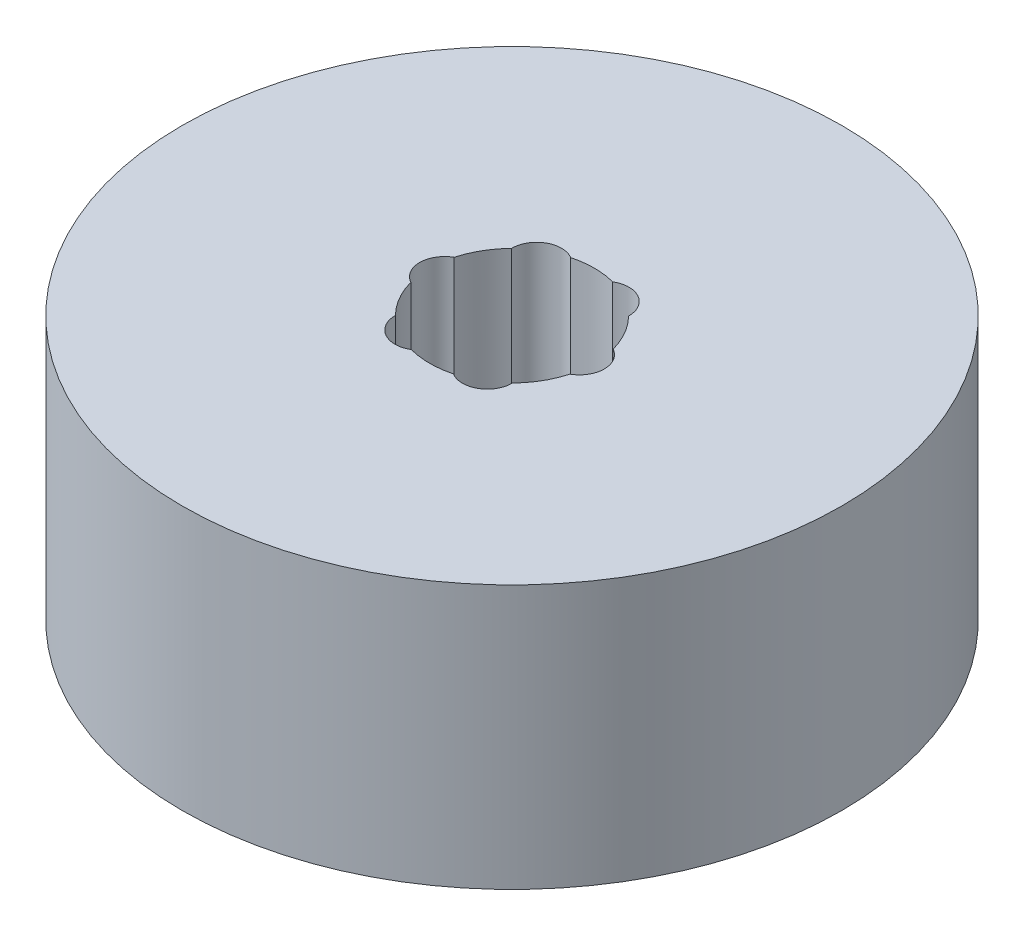
ISO-10303-21;
HEADER;
FILE_DESCRIPTION(('STEP AP214'),'2;1');
FILE_NAME('part.step','',(''),(''),'','','');
FILE_SCHEMA(('AUTOMOTIVE_DESIGN { 1 0 10303 214 1 1 1 1 }'));
ENDSEC;
DATA;
#1=APPLICATION_CONTEXT('core data for automotive mechanical design processes');
#2=APPLICATION_PROTOCOL_DEFINITION('international standard','automotive_design',2000,#1);
#3=PRODUCT_CONTEXT('',#1,'mechanical');
#4=PRODUCT('Part','Part','',(#3));
#5=PRODUCT_RELATED_PRODUCT_CATEGORY('part','',(#4));
#6=PRODUCT_DEFINITION_FORMATION('','',#4);
#7=PRODUCT_DEFINITION_CONTEXT('part definition',#1,'design');
#8=PRODUCT_DEFINITION('design','',#6,#7);
#9=PRODUCT_DEFINITION_SHAPE('','',#8);
#10=(LENGTH_UNIT() NAMED_UNIT(*) SI_UNIT(.MILLI.,.METRE.));
#11=(NAMED_UNIT(*) PLANE_ANGLE_UNIT() SI_UNIT($,.RADIAN.));
#12=(NAMED_UNIT(*) SI_UNIT($,.STERADIAN.) SOLID_ANGLE_UNIT());
#13=UNCERTAINTY_MEASURE_WITH_UNIT(LENGTH_MEASURE(1.E-05),#10,'distance_accuracy_value','');
#14=(GEOMETRIC_REPRESENTATION_CONTEXT(3) GLOBAL_UNCERTAINTY_ASSIGNED_CONTEXT((#13)) GLOBAL_UNIT_ASSIGNED_CONTEXT((#10,
#11,#12)) REPRESENTATION_CONTEXT('',''));
#15=CARTESIAN_POINT('',(0.,0.,0.));
#16=DIRECTION('',(0.,0.,1.));
#17=DIRECTION('',(1.,0.,0.));
#18=AXIS2_PLACEMENT_3D('',#15,#16,#17);
#19=CARTESIAN_POINT('',(0.,16.,0.));
#20=DIRECTION('',(0.,-1.,0.));
#21=DIRECTION('',(0.,0.,-1.));
#22=AXIS2_PLACEMENT_3D('',#19,#20,#21);
#23=CYLINDRICAL_SURFACE('',#22,20.);
#24=CARTESIAN_POINT('',(0.,16.,0.));
#25=DIRECTION('',(0.,1.,0.));
#26=DIRECTION('',(0.,0.,1.));
#27=AXIS2_PLACEMENT_3D('',#24,#25,#26);
#28=CIRCLE('',#27,20.);
#29=CARTESIAN_POINT('',(0.,16.,20.));
#30=VERTEX_POINT('',#29);
#31=EDGE_CURVE('E162',#30,#30,#28,.T.);
#32=ORIENTED_EDGE('',*,*,#31,.F.);
#33=EDGE_LOOP('',(#32));
#34=FACE_BOUND('',#33,.T.);
#35=CARTESIAN_POINT('',(0.,0.,0.));
#36=DIRECTION('',(0.,1.,0.));
#37=DIRECTION('',(0.,0.,1.));
#38=AXIS2_PLACEMENT_3D('',#35,#36,#37);
#39=CIRCLE('',#38,20.);
#40=CARTESIAN_POINT('',(0.,0.,20.));
#41=VERTEX_POINT('',#40);
#42=EDGE_CURVE('E157',#41,#41,#39,.T.);
#43=ORIENTED_EDGE('',*,*,#42,.T.);
#44=EDGE_LOOP('',(#43));
#45=FACE_BOUND('',#44,.T.);
#46=ADVANCED_FACE('F39',(#34,#45),#23,.T.);
#47=CARTESIAN_POINT('',(0.,16.,0.));
#48=DIRECTION('',(0.,1.,0.));
#49=DIRECTION('',(0.,0.,1.));
#50=AXIS2_PLACEMENT_3D('',#47,#48,#49);
#51=PLANE('',#50);
#52=CARTESIAN_POINT('',(-2.04657231272091,16.,-3.54476722699626));
#53=DIRECTION('',(0.,1.,0.));
#54=DIRECTION('',(-0.866025403784433,0.,0.50000000000001));
#55=AXIS2_PLACEMENT_3D('',#52,#53,#54);
#56=CIRCLE('',#55,1.50471446293736);
#57=CARTESIAN_POINT('',(-1.2727972459606,16.,-4.83528563485914));
#58=VERTEX_POINT('',#57);
#59=CARTESIAN_POINT('',(-3.55108157136176,16.,-3.51991756629823));
#60=VERTEX_POINT('',#59);
#61=EDGE_CURVE('E218',#58,#60,#56,.T.);
#62=ORIENTED_EDGE('',*,*,#61,.F.);
#63=CARTESIAN_POINT('',(0.,16.,0.));
#64=DIRECTION('',(0.,1.,0.));
#65=DIRECTION('',(0.,0.,1.));
#66=AXIS2_PLACEMENT_3D('',#63,#64,#65);
#67=CIRCLE('',#66,5.);
#68=CARTESIAN_POINT('',(1.27279724596049,16.,-4.83528563485916));
#69=VERTEX_POINT('',#68);
#70=EDGE_CURVE('E169',#69,#58,#67,.T.);
#71=ORIENTED_EDGE('',*,*,#70,.F.);
#72=CARTESIAN_POINT('',(2.04657231272084,16.,-3.5447672269963));
#73=DIRECTION('',(0.,1.,0.));
#74=DIRECTION('',(-0.866025403784443,0.,-0.499999999999992));
#75=AXIS2_PLACEMENT_3D('',#72,#73,#74);
#76=CIRCLE('',#75,1.50471446293736);
#77=CARTESIAN_POINT('',(3.55108157136169,16.,-3.51991756629831));
#78=VERTEX_POINT('',#77);
#79=EDGE_CURVE('E285',#78,#69,#76,.T.);
#80=ORIENTED_EDGE('',*,*,#79,.F.);
#81=CARTESIAN_POINT('',(4.82387881732226,16.,-1.31536806856088));
#82=VERTEX_POINT('',#81);
#83=EDGE_CURVE('E174',#82,#78,#67,.T.);
#84=ORIENTED_EDGE('',*,*,#83,.F.);
#85=CARTESIAN_POINT('',(4.09314462544174,16.,0.));
#86=DIRECTION('',(0.,1.,0.));
#87=DIRECTION('',(0.,0.,-1.));
#88=AXIS2_PLACEMENT_3D('',#85,#86,#87);
#89=CIRCLE('',#88,1.50471446293736);
#90=CARTESIAN_POINT('',(4.82387881732226,16.,1.31536806856088));
#91=VERTEX_POINT('',#90);
#92=EDGE_CURVE('E280',#91,#82,#89,.T.);
#93=ORIENTED_EDGE('',*,*,#92,.F.);
#94=CARTESIAN_POINT('',(3.55108157136174,16.,3.51991756629826));
#95=VERTEX_POINT('',#94);
#96=EDGE_CURVE('E164',#95,#91,#67,.T.);
#97=ORIENTED_EDGE('',*,*,#96,.F.);
#98=CARTESIAN_POINT('',(2.04657231272089,16.,3.54476722699628));
#99=DIRECTION('',(0.,1.,0.));
#100=DIRECTION('',(0.866025403784436,0.,-0.500000000000004));
#101=AXIS2_PLACEMENT_3D('',#98,#99,#100);
#102=CIRCLE('',#101,1.50471446293736);
#103=CARTESIAN_POINT('',(1.27279724596056,16.,4.83528563485915));
#104=VERTEX_POINT('',#103);
#105=EDGE_CURVE('E269',#104,#95,#102,.T.);
#106=ORIENTED_EDGE('',*,*,#105,.F.);
#107=CARTESIAN_POINT('',(-1.27279724596053,16.,4.83528563485915));
#108=VERTEX_POINT('',#107);
#109=EDGE_CURVE('E149',#108,#104,#67,.T.);
#110=ORIENTED_EDGE('',*,*,#109,.F.);
#111=CARTESIAN_POINT('',(-2.04657231272086,16.,3.54476722699629));
#112=DIRECTION('',(0.,1.,0.));
#113=DIRECTION('',(0.86602540378444,0.,0.499999999999998));
#114=AXIS2_PLACEMENT_3D('',#111,#112,#113);
#115=CIRCLE('',#114,1.50471446293736);
#116=CARTESIAN_POINT('',(-3.55108157136172,16.,3.51991756629828));
#117=VERTEX_POINT('',#116);
#118=EDGE_CURVE('E128',#117,#108,#115,.T.);
#119=ORIENTED_EDGE('',*,*,#118,.F.);
#120=CARTESIAN_POINT('',(-4.82387881732226,16.,1.31536806856088));
#121=VERTEX_POINT('',#120);
#122=EDGE_CURVE('E148',#121,#117,#67,.T.);
#123=ORIENTED_EDGE('',*,*,#122,.F.);
#124=CARTESIAN_POINT('',(-4.09314462544174,16.,0.));
#125=DIRECTION('',(0.,1.,0.));
#126=DIRECTION('',(0.,0.,1.));
#127=AXIS2_PLACEMENT_3D('',#124,#125,#126);
#128=CIRCLE('',#127,1.50471446293736);
#129=CARTESIAN_POINT('',(-4.82387881732226,16.,-1.31536806856088));
#130=VERTEX_POINT('',#129);
#131=EDGE_CURVE('E179',#130,#121,#128,.T.);
#132=ORIENTED_EDGE('',*,*,#131,.F.);
#133=EDGE_CURVE('E161',#60,#130,#67,.T.);
#134=ORIENTED_EDGE('',*,*,#133,.F.);
#135=EDGE_LOOP('',(#62,#71,#80,#84,#93,#97,#106,#110,#119,#123,#132,#134));
#136=FACE_BOUND('',#135,.T.);
#137=ORIENTED_EDGE('',*,*,#31,.T.);
#138=EDGE_LOOP('',(#137));
#139=FACE_BOUND('',#138,.T.);
#140=ADVANCED_FACE('F141',(#136,#139),#51,.T.);
#141=CARTESIAN_POINT('',(0.,0.,0.));
#142=DIRECTION('',(0.,1.,0.));
#143=DIRECTION('',(0.,0.,1.));
#144=AXIS2_PLACEMENT_3D('',#141,#142,#143);
#145=PLANE('',#144);
#146=CARTESIAN_POINT('',(0.,0.,0.));
#147=DIRECTION('',(0.,1.,0.));
#148=DIRECTION('',(0.,0.,1.));
#149=AXIS2_PLACEMENT_3D('',#146,#147,#148);
#150=CIRCLE('',#149,5.);
#151=CARTESIAN_POINT('',(0.,0.,5.));
#152=VERTEX_POINT('',#151);
#153=EDGE_CURVE('E166',#152,#152,#150,.T.);
#154=ORIENTED_EDGE('',*,*,#153,.T.);
#155=EDGE_LOOP('',(#154));
#156=FACE_BOUND('',#155,.T.);
#157=ORIENTED_EDGE('',*,*,#42,.F.);
#158=EDGE_LOOP('',(#157));
#159=FACE_BOUND('',#158,.T.);
#160=ADVANCED_FACE('F234',(#156,#159),#145,.F.);
#161=CARTESIAN_POINT('',(0.,16.,0.));
#162=DIRECTION('',(0.,-1.,0.));
#163=DIRECTION('',(0.,0.,-1.));
#164=AXIS2_PLACEMENT_3D('',#161,#162,#163);
#165=CYLINDRICAL_SURFACE('',#164,5.);
#166=DIRECTION('',(0.,1.,0.));
#167=VECTOR('',#166,1.);
#168=CARTESIAN_POINT('',(-1.2727972459606,9.64388291955747,-4.83528563485914));
#169=LINE('',#168,#167);
#170=CARTESIAN_POINT('',(-1.2727972459606,3.28776583911494,-4.83528563485914));
#171=VERTEX_POINT('',#170);
#172=EDGE_CURVE('E11',#171,#58,#169,.T.);
#173=ORIENTED_EDGE('',*,*,#172,.F.);
#174=CARTESIAN_POINT('',(0.,3.28776583911494,0.));
#175=DIRECTION('',(0.,1.,0.));
#176=DIRECTION('',(0.,0.,1.));
#177=AXIS2_PLACEMENT_3D('',#174,#175,#176);
#178=CIRCLE('',#177,5.);
#179=CARTESIAN_POINT('',(-3.55108157136176,3.28776583911494,-3.51991756629823));
#180=VERTEX_POINT('',#179);
#181=EDGE_CURVE('E214',#171,#180,#178,.T.);
#182=ORIENTED_EDGE('',*,*,#181,.T.);
#183=DIRECTION('',(0.,1.,0.));
#184=VECTOR('',#183,1.);
#185=CARTESIAN_POINT('',(-3.55108157136176,9.64388291955747,-3.51991756629823));
#186=LINE('',#185,#184);
#187=EDGE_CURVE('E46',#60,#180,#186,.F.);
#188=ORIENTED_EDGE('',*,*,#187,.F.);
#189=ORIENTED_EDGE('',*,*,#133,.T.);
#190=DIRECTION('',(0.,1.,0.));
#191=VECTOR('',#190,1.);
#192=CARTESIAN_POINT('',(-4.82387881732226,9.64388291955747,-1.31536806856088));
#193=LINE('',#192,#191);
#194=CARTESIAN_POINT('',(-4.82387881732226,3.28776583911494,-1.31536806856088));
#195=VERTEX_POINT('',#194);
#196=EDGE_CURVE('E187',#195,#130,#193,.T.);
#197=ORIENTED_EDGE('',*,*,#196,.F.);
#198=CARTESIAN_POINT('',(0.,3.28776583911494,0.));
#199=DIRECTION('',(0.,1.,0.));
#200=DIRECTION('',(0.,0.,1.));
#201=AXIS2_PLACEMENT_3D('',#198,#199,#200);
#202=CIRCLE('',#201,5.);
#203=CARTESIAN_POINT('',(-4.82387881732226,3.28776583911494,1.31536806856088));
#204=VERTEX_POINT('',#203);
#205=EDGE_CURVE('E184',#195,#204,#202,.T.);
#206=ORIENTED_EDGE('',*,*,#205,.T.);
#207=DIRECTION('',(0.,1.,0.));
#208=VECTOR('',#207,1.);
#209=CARTESIAN_POINT('',(-4.82387881732226,9.64388291955747,1.31536806856088));
#210=LINE('',#209,#208);
#211=EDGE_CURVE('E158',#121,#204,#210,.F.);
#212=ORIENTED_EDGE('',*,*,#211,.F.);
#213=ORIENTED_EDGE('',*,*,#122,.T.);
#214=DIRECTION('',(0.,1.,0.));
#215=VECTOR('',#214,1.);
#216=CARTESIAN_POINT('',(-3.55108157136171,9.64388291955747,3.51991756629828));
#217=LINE('',#216,#215);
#218=CARTESIAN_POINT('',(-3.55108157136172,3.28776583911494,3.51991756629828));
#219=VERTEX_POINT('',#218);
#220=EDGE_CURVE('E127',#219,#117,#217,.T.);
#221=ORIENTED_EDGE('',*,*,#220,.F.);
#222=CARTESIAN_POINT('',(0.,3.28776583911494,0.));
#223=DIRECTION('',(0.,1.,0.));
#224=DIRECTION('',(0.,0.,1.));
#225=AXIS2_PLACEMENT_3D('',#222,#223,#224);
#226=CIRCLE('',#225,5.);
#227=CARTESIAN_POINT('',(-1.27279724596053,3.28776583911494,4.83528563485915));
#228=VERTEX_POINT('',#227);
#229=EDGE_CURVE('E189',#219,#228,#226,.T.);
#230=ORIENTED_EDGE('',*,*,#229,.T.);
#231=DIRECTION('',(0.,1.,0.));
#232=VECTOR('',#231,1.);
#233=CARTESIAN_POINT('',(-1.27279724596053,9.64388291955747,4.83528563485915));
#234=LINE('',#233,#232);
#235=EDGE_CURVE('E140',#108,#228,#234,.F.);
#236=ORIENTED_EDGE('',*,*,#235,.F.);
#237=ORIENTED_EDGE('',*,*,#109,.T.);
#238=DIRECTION('',(0.,1.,0.));
#239=VECTOR('',#238,1.);
#240=CARTESIAN_POINT('',(1.27279724596056,9.64388291955747,4.83528563485915));
#241=LINE('',#240,#239);
#242=CARTESIAN_POINT('',(1.27279724596056,3.28776583911494,4.83528563485915));
#243=VERTEX_POINT('',#242);
#244=EDGE_CURVE('E196',#243,#104,#241,.T.);
#245=ORIENTED_EDGE('',*,*,#244,.F.);
#246=CARTESIAN_POINT('',(0.,3.28776583911494,0.));
#247=DIRECTION('',(0.,1.,0.));
#248=DIRECTION('',(0.,0.,1.));
#249=AXIS2_PLACEMENT_3D('',#246,#247,#248);
#250=CIRCLE('',#249,5.);
#251=CARTESIAN_POINT('',(3.55108157136174,3.28776583911494,3.51991756629826));
#252=VERTEX_POINT('',#251);
#253=EDGE_CURVE('E136',#243,#252,#250,.T.);
#254=ORIENTED_EDGE('',*,*,#253,.T.);
#255=DIRECTION('',(0.,1.,0.));
#256=VECTOR('',#255,1.);
#257=CARTESIAN_POINT('',(3.55108157136174,9.64388291955747,3.51991756629826));
#258=LINE('',#257,#256);
#259=EDGE_CURVE('E194',#95,#252,#258,.F.);
#260=ORIENTED_EDGE('',*,*,#259,.F.);
#261=ORIENTED_EDGE('',*,*,#96,.T.);
#262=DIRECTION('',(0.,1.,0.));
#263=VECTOR('',#262,1.);
#264=CARTESIAN_POINT('',(4.82387881732226,9.64388291955747,1.31536806856088));
#265=LINE('',#264,#263);
#266=CARTESIAN_POINT('',(4.82387881732226,3.28776583911494,1.31536806856088));
#267=VERTEX_POINT('',#266);
#268=EDGE_CURVE('E206',#267,#91,#265,.T.);
#269=ORIENTED_EDGE('',*,*,#268,.F.);
#270=CARTESIAN_POINT('',(0.,3.28776583911494,0.));
#271=DIRECTION('',(0.,1.,0.));
#272=DIRECTION('',(0.,0.,1.));
#273=AXIS2_PLACEMENT_3D('',#270,#271,#272);
#274=CIRCLE('',#273,5.);
#275=CARTESIAN_POINT('',(4.82387881732226,3.28776583911494,-1.31536806856088));
#276=VERTEX_POINT('',#275);
#277=EDGE_CURVE('E199',#267,#276,#274,.T.);
#278=ORIENTED_EDGE('',*,*,#277,.T.);
#279=DIRECTION('',(0.,1.,0.));
#280=VECTOR('',#279,1.);
#281=CARTESIAN_POINT('',(4.82387881732226,9.64388291955747,-1.31536806856088));
#282=LINE('',#281,#280);
#283=EDGE_CURVE('E201',#82,#276,#282,.F.);
#284=ORIENTED_EDGE('',*,*,#283,.F.);
#285=ORIENTED_EDGE('',*,*,#83,.T.);
#286=DIRECTION('',(0.,1.,0.));
#287=VECTOR('',#286,1.);
#288=CARTESIAN_POINT('',(3.55108157136169,9.64388291955747,-3.51991756629831));
#289=LINE('',#288,#287);
#290=CARTESIAN_POINT('',(3.55108157136169,3.28776583911494,-3.51991756629831));
#291=VERTEX_POINT('',#290);
#292=EDGE_CURVE('E213',#291,#78,#289,.T.);
#293=ORIENTED_EDGE('',*,*,#292,.F.);
#294=CARTESIAN_POINT('',(0.,3.28776583911494,0.));
#295=DIRECTION('',(0.,1.,0.));
#296=DIRECTION('',(0.,0.,1.));
#297=AXIS2_PLACEMENT_3D('',#294,#295,#296);
#298=CIRCLE('',#297,5.);
#299=CARTESIAN_POINT('',(1.27279724596049,3.28776583911494,-4.83528563485916));
#300=VERTEX_POINT('',#299);
#301=EDGE_CURVE('E208',#291,#300,#298,.T.);
#302=ORIENTED_EDGE('',*,*,#301,.T.);
#303=DIRECTION('',(0.,1.,0.));
#304=VECTOR('',#303,1.);
#305=CARTESIAN_POINT('',(1.27279724596049,9.64388291955747,-4.83528563485916));
#306=LINE('',#305,#304);
#307=EDGE_CURVE('E211',#69,#300,#306,.F.);
#308=ORIENTED_EDGE('',*,*,#307,.F.);
#309=ORIENTED_EDGE('',*,*,#70,.T.);
#310=EDGE_LOOP('',(#173,#182,#188,#189,#197,#206,#212,#213,#221,#230,#236,#237,#245,#254,#260,
#261,#269,#278,#284,#285,#293,#302,#308,#309));
#311=FACE_BOUND('',#310,.T.);
#312=ORIENTED_EDGE('',*,*,#153,.F.);
#313=EDGE_LOOP('',(#312));
#314=FACE_BOUND('',#313,.T.);
#315=ADVANCED_FACE('F152',(#311,#314),#165,.F.);
#316=CARTESIAN_POINT('',(-4.09314462544174,3.28776583911494,0.));
#317=DIRECTION('',(0.,1.,0.));
#318=DIRECTION('',(0.,0.,1.));
#319=AXIS2_PLACEMENT_3D('',#316,#317,#318);
#320=CYLINDRICAL_SURFACE('',#319,1.50471446293736);
#321=ORIENTED_EDGE('',*,*,#196,.T.);
#322=ORIENTED_EDGE('',*,*,#131,.T.);
#323=ORIENTED_EDGE('',*,*,#211,.T.);
#324=CARTESIAN_POINT('',(-4.09314462544174,3.28776583911494,0.));
#325=DIRECTION('',(0.,1.,0.));
#326=DIRECTION('',(0.,0.,1.));
#327=AXIS2_PLACEMENT_3D('',#324,#325,#326);
#328=CIRCLE('',#327,1.50471446293736);
#329=EDGE_CURVE('E180',#195,#204,#328,.T.);
#330=ORIENTED_EDGE('',*,*,#329,.F.);
#331=EDGE_LOOP('',(#321,#322,#323,#330));
#332=FACE_BOUND('',#331,.T.);
#333=ADVANCED_FACE('F244',(#332),#320,.F.);
#334=CARTESIAN_POINT('',(-4.09314462544174,3.28776583911494,0.));
#335=DIRECTION('',(0.,1.,0.));
#336=DIRECTION('',(0.,0.,1.));
#337=AXIS2_PLACEMENT_3D('',#334,#335,#336);
#338=PLANE('',#337);
#339=ORIENTED_EDGE('',*,*,#329,.T.);
#340=ORIENTED_EDGE('',*,*,#205,.F.);
#341=EDGE_LOOP('',(#339,#340));
#342=FACE_BOUND('',#341,.T.);
#343=ADVANCED_FACE('F248',(#342),#338,.T.);
#344=CARTESIAN_POINT('',(-2.04657231272086,3.28776583911494,3.54476722699629));
#345=DIRECTION('',(0.,1.,0.));
#346=DIRECTION('',(0.,0.,1.));
#347=AXIS2_PLACEMENT_3D('',#344,#345,#346);
#348=CYLINDRICAL_SURFACE('',#347,1.50471446293736);
#349=ORIENTED_EDGE('',*,*,#220,.T.);
#350=ORIENTED_EDGE('',*,*,#118,.T.);
#351=ORIENTED_EDGE('',*,*,#235,.T.);
#352=CARTESIAN_POINT('',(-2.04657231272086,3.28776583911494,3.54476722699629));
#353=DIRECTION('',(0.,1.,0.));
#354=DIRECTION('',(0.86602540378444,0.,0.499999999999998));
#355=AXIS2_PLACEMENT_3D('',#352,#353,#354);
#356=CIRCLE('',#355,1.50471446293736);
#357=EDGE_CURVE('E135',#219,#228,#356,.T.);
#358=ORIENTED_EDGE('',*,*,#357,.F.);
#359=EDGE_LOOP('',(#349,#350,#351,#358));
#360=FACE_BOUND('',#359,.T.);
#361=ADVANCED_FACE('F126',(#360),#348,.F.);
#362=CARTESIAN_POINT('',(-2.04657231272086,3.28776583911494,3.54476722699629));
#363=DIRECTION('',(0.,1.,0.));
#364=DIRECTION('',(0.86602540378444,0.,0.499999999999998));
#365=AXIS2_PLACEMENT_3D('',#362,#363,#364);
#366=PLANE('',#365);
#367=ORIENTED_EDGE('',*,*,#357,.T.);
#368=ORIENTED_EDGE('',*,*,#229,.F.);
#369=EDGE_LOOP('',(#367,#368));
#370=FACE_BOUND('',#369,.T.);
#371=ADVANCED_FACE('F258',(#370),#366,.T.);
#372=CARTESIAN_POINT('',(2.04657231272089,3.28776583911494,3.54476722699628));
#373=DIRECTION('',(0.,1.,0.));
#374=DIRECTION('',(0.,0.,1.));
#375=AXIS2_PLACEMENT_3D('',#372,#373,#374);
#376=CYLINDRICAL_SURFACE('',#375,1.50471446293736);
#377=ORIENTED_EDGE('',*,*,#244,.T.);
#378=ORIENTED_EDGE('',*,*,#105,.T.);
#379=ORIENTED_EDGE('',*,*,#259,.T.);
#380=CARTESIAN_POINT('',(2.04657231272089,3.28776583911494,3.54476722699628));
#381=DIRECTION('',(0.,1.,0.));
#382=DIRECTION('',(0.866025403784436,0.,-0.500000000000004));
#383=AXIS2_PLACEMENT_3D('',#380,#381,#382);
#384=CIRCLE('',#383,1.50471446293736);
#385=EDGE_CURVE('E147',#243,#252,#384,.T.);
#386=ORIENTED_EDGE('',*,*,#385,.F.);
#387=EDGE_LOOP('',(#377,#378,#379,#386));
#388=FACE_BOUND('',#387,.T.);
#389=ADVANCED_FACE('F256',(#388),#376,.F.);
#390=CARTESIAN_POINT('',(2.04657231272089,3.28776583911494,3.54476722699628));
#391=DIRECTION('',(0.,1.,0.));
#392=DIRECTION('',(0.866025403784436,0.,-0.500000000000004));
#393=AXIS2_PLACEMENT_3D('',#390,#391,#392);
#394=PLANE('',#393);
#395=ORIENTED_EDGE('',*,*,#385,.T.);
#396=ORIENTED_EDGE('',*,*,#253,.F.);
#397=EDGE_LOOP('',(#395,#396));
#398=FACE_BOUND('',#397,.T.);
#399=ADVANCED_FACE('F263',(#398),#394,.T.);
#400=CARTESIAN_POINT('',(4.09314462544174,3.28776583911494,0.));
#401=DIRECTION('',(0.,1.,0.));
#402=DIRECTION('',(0.,0.,1.));
#403=AXIS2_PLACEMENT_3D('',#400,#401,#402);
#404=CYLINDRICAL_SURFACE('',#403,1.50471446293736);
#405=ORIENTED_EDGE('',*,*,#268,.T.);
#406=ORIENTED_EDGE('',*,*,#92,.T.);
#407=ORIENTED_EDGE('',*,*,#283,.T.);
#408=CARTESIAN_POINT('',(4.09314462544174,3.28776583911494,0.));
#409=DIRECTION('',(0.,1.,0.));
#410=DIRECTION('',(0.,0.,-1.));
#411=AXIS2_PLACEMENT_3D('',#408,#409,#410);
#412=CIRCLE('',#411,1.50471446293736);
#413=EDGE_CURVE('E273',#267,#276,#412,.T.);
#414=ORIENTED_EDGE('',*,*,#413,.F.);
#415=EDGE_LOOP('',(#405,#406,#407,#414));
#416=FACE_BOUND('',#415,.T.);
#417=ADVANCED_FACE('F297',(#416),#404,.F.);
#418=CARTESIAN_POINT('',(4.09314462544174,3.28776583911494,0.));
#419=DIRECTION('',(0.,1.,0.));
#420=DIRECTION('',(0.,0.,-1.));
#421=AXIS2_PLACEMENT_3D('',#418,#419,#420);
#422=PLANE('',#421);
#423=ORIENTED_EDGE('',*,*,#413,.T.);
#424=ORIENTED_EDGE('',*,*,#277,.F.);
#425=EDGE_LOOP('',(#423,#424));
#426=FACE_BOUND('',#425,.T.);
#427=ADVANCED_FACE('F299',(#426),#422,.T.);
#428=CARTESIAN_POINT('',(2.04657231272084,3.28776583911494,-3.5447672269963));
#429=DIRECTION('',(0.,1.,0.));
#430=DIRECTION('',(0.,0.,1.));
#431=AXIS2_PLACEMENT_3D('',#428,#429,#430);
#432=CYLINDRICAL_SURFACE('',#431,1.50471446293736);
#433=ORIENTED_EDGE('',*,*,#292,.T.);
#434=ORIENTED_EDGE('',*,*,#79,.T.);
#435=ORIENTED_EDGE('',*,*,#307,.T.);
#436=CARTESIAN_POINT('',(2.04657231272084,3.28776583911494,-3.5447672269963));
#437=DIRECTION('',(0.,1.,0.));
#438=DIRECTION('',(-0.866025403784443,0.,-0.499999999999992));
#439=AXIS2_PLACEMENT_3D('',#436,#437,#438);
#440=CIRCLE('',#439,1.50471446293736);
#441=EDGE_CURVE('E56',#291,#300,#440,.T.);
#442=ORIENTED_EDGE('',*,*,#441,.F.);
#443=EDGE_LOOP('',(#433,#434,#435,#442));
#444=FACE_BOUND('',#443,.T.);
#445=ADVANCED_FACE('F292',(#444),#432,.F.);
#446=CARTESIAN_POINT('',(2.04657231272084,3.28776583911494,-3.5447672269963));
#447=DIRECTION('',(0.,1.,0.));
#448=DIRECTION('',(-0.866025403784443,0.,-0.499999999999992));
#449=AXIS2_PLACEMENT_3D('',#446,#447,#448);
#450=PLANE('',#449);
#451=ORIENTED_EDGE('',*,*,#441,.T.);
#452=ORIENTED_EDGE('',*,*,#301,.F.);
#453=EDGE_LOOP('',(#451,#452));
#454=FACE_BOUND('',#453,.T.);
#455=ADVANCED_FACE('F226',(#454),#450,.T.);
#456=CARTESIAN_POINT('',(-2.04657231272091,3.28776583911494,-3.54476722699626));
#457=DIRECTION('',(0.,1.,0.));
#458=DIRECTION('',(0.,0.,1.));
#459=AXIS2_PLACEMENT_3D('',#456,#457,#458);
#460=CYLINDRICAL_SURFACE('',#459,1.50471446293736);
#461=ORIENTED_EDGE('',*,*,#172,.T.);
#462=ORIENTED_EDGE('',*,*,#61,.T.);
#463=ORIENTED_EDGE('',*,*,#187,.T.);
#464=CARTESIAN_POINT('',(-2.04657231272091,3.28776583911494,-3.54476722699626));
#465=DIRECTION('',(0.,1.,0.));
#466=DIRECTION('',(-0.866025403784433,0.,0.50000000000001));
#467=AXIS2_PLACEMENT_3D('',#464,#465,#466);
#468=CIRCLE('',#467,1.50471446293736);
#469=EDGE_CURVE('E55',#171,#180,#468,.T.);
#470=ORIENTED_EDGE('',*,*,#469,.F.);
#471=EDGE_LOOP('',(#461,#462,#463,#470));
#472=FACE_BOUND('',#471,.T.);
#473=ADVANCED_FACE('F217',(#472),#460,.F.);
#474=CARTESIAN_POINT('',(-2.04657231272091,3.28776583911494,-3.54476722699626));
#475=DIRECTION('',(0.,1.,0.));
#476=DIRECTION('',(-0.866025403784433,0.,0.50000000000001));
#477=AXIS2_PLACEMENT_3D('',#474,#475,#476);
#478=PLANE('',#477);
#479=ORIENTED_EDGE('',*,*,#469,.T.);
#480=ORIENTED_EDGE('',*,*,#181,.F.);
#481=EDGE_LOOP('',(#479,#480));
#482=FACE_BOUND('',#481,.T.);
#483=ADVANCED_FACE('F219',(#482),#478,.T.);
#484=CLOSED_SHELL('',(#46,#140,#160,#315,#333,#343,#361,#371,#389,#399,#417,#427,#445,#455,#473,#483));
#485=MANIFOLD_SOLID_BREP('B2',#484);
#486=ADVANCED_BREP_SHAPE_REPRESENTATION('',(#18,#485),#14);
#487=SHAPE_DEFINITION_REPRESENTATION(#9,#486);
ENDSEC;
END-ISO-10303-21;
